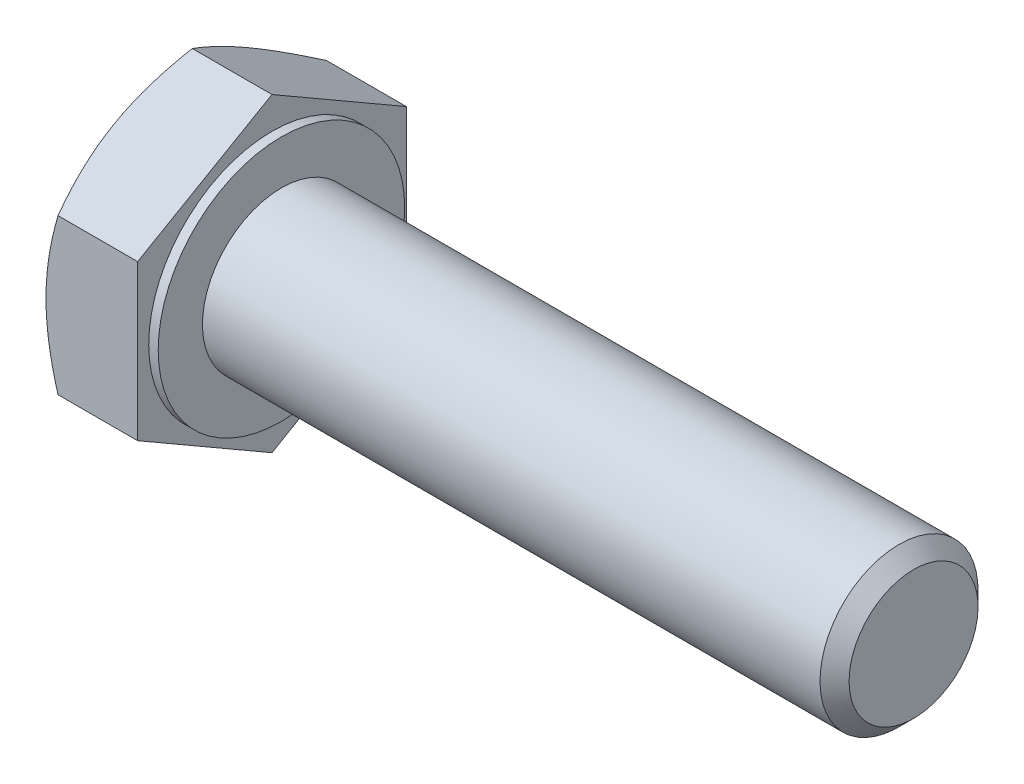
ISO-10303-21;
HEADER;
FILE_DESCRIPTION(('STEP AP214'),'2;1');
FILE_NAME('part.step','',(''),(''),'','','');
FILE_SCHEMA(('AUTOMOTIVE_DESIGN { 1 0 10303 214 1 1 1 1 }'));
ENDSEC;
DATA;
#1=APPLICATION_CONTEXT('core data for automotive mechanical design processes');
#2=APPLICATION_PROTOCOL_DEFINITION('international standard','automotive_design',2000,#1);
#3=PRODUCT_CONTEXT('',#1,'mechanical');
#4=PRODUCT('Part','Part','',(#3));
#5=PRODUCT_RELATED_PRODUCT_CATEGORY('part','',(#4));
#6=PRODUCT_DEFINITION_FORMATION('','',#4);
#7=PRODUCT_DEFINITION_CONTEXT('part definition',#1,'design');
#8=PRODUCT_DEFINITION('design','',#6,#7);
#9=PRODUCT_DEFINITION_SHAPE('','',#8);
#10=(LENGTH_UNIT() NAMED_UNIT(*) SI_UNIT(.MILLI.,.METRE.));
#11=(NAMED_UNIT(*) PLANE_ANGLE_UNIT() SI_UNIT($,.RADIAN.));
#12=(NAMED_UNIT(*) SI_UNIT($,.STERADIAN.) SOLID_ANGLE_UNIT());
#13=UNCERTAINTY_MEASURE_WITH_UNIT(LENGTH_MEASURE(1.E-05),#10,'distance_accuracy_value','');
#14=(GEOMETRIC_REPRESENTATION_CONTEXT(3) GLOBAL_UNCERTAINTY_ASSIGNED_CONTEXT((#13)) GLOBAL_UNIT_ASSIGNED_CONTEXT((#10,
#11,#12)) REPRESENTATION_CONTEXT('',''));
#15=CARTESIAN_POINT('',(0.,0.,0.));
#16=DIRECTION('',(0.,0.,1.));
#17=DIRECTION('',(1.,0.,0.));
#18=AXIS2_PLACEMENT_3D('',#15,#16,#17);
#19=CARTESIAN_POINT('',(39.5398625,0.,0.));
#20=DIRECTION('',(-1.,0.,0.));
#21=DIRECTION('',(0.,1.,0.));
#22=AXIS2_PLACEMENT_3D('',#19,#20,#21);
#23=CONICAL_SURFACE('',#22,4.5399125,0.785343828859751);
#24=CARTESIAN_POINT('',(39.079725,0.,0.));
#25=DIRECTION('',(1.,0.,0.));
#26=DIRECTION('',(0.,1.,0.));
#27=AXIS2_PLACEMENT_3D('',#24,#25,#26);
#28=CIRCLE('',#27,5.);
#29=CARTESIAN_POINT('',(39.079725,5.00000000000001,0.));
#30=VERTEX_POINT('',#29);
#31=EDGE_CURVE('E10',#30,#30,#28,.T.);
#32=ORIENTED_EDGE('',*,*,#31,.T.);
#33=EDGE_LOOP('',(#32));
#34=FACE_BOUND('',#33,.T.);
#35=CARTESIAN_POINT('',(40.,0.,0.));
#36=DIRECTION('',(-1.,0.,0.));
#37=DIRECTION('',(0.,1.,0.));
#38=AXIS2_PLACEMENT_3D('',#35,#36,#37);
#39=CIRCLE('',#38,4.079825);
#40=CARTESIAN_POINT('',(40.,4.07982500000001,0.));
#41=VERTEX_POINT('',#40);
#42=EDGE_CURVE('E26',#41,#41,#39,.T.);
#43=ORIENTED_EDGE('',*,*,#42,.T.);
#44=EDGE_LOOP('',(#43));
#45=FACE_BOUND('',#44,.T.);
#46=ADVANCED_FACE('F16',(#34,#45),#23,.T.);
#47=CARTESIAN_POINT('',(27.,0.,0.));
#48=DIRECTION('',(1.,0.,0.));
#49=DIRECTION('',(0.,1.,0.));
#50=AXIS2_PLACEMENT_3D('',#47,#48,#49);
#51=CYLINDRICAL_SURFACE('',#50,5.);
#52=CARTESIAN_POINT('',(0.,0.,0.));
#53=DIRECTION('',(1.,0.,0.));
#54=DIRECTION('',(0.,1.,0.));
#55=AXIS2_PLACEMENT_3D('',#52,#53,#54);
#56=CIRCLE('',#55,5.);
#57=CARTESIAN_POINT('',(0.,5.,0.));
#58=VERTEX_POINT('',#57);
#59=EDGE_CURVE('E165',#58,#58,#56,.T.);
#60=ORIENTED_EDGE('',*,*,#59,.T.);
#61=EDGE_LOOP('',(#60));
#62=FACE_BOUND('',#61,.T.);
#63=ORIENTED_EDGE('',*,*,#31,.F.);
#64=EDGE_LOOP('',(#63));
#65=FACE_BOUND('',#64,.T.);
#66=ADVANCED_FACE('F251',(#62,#65),#51,.T.);
#67=CARTESIAN_POINT('',(40.,2.5,0.));
#68=DIRECTION('',(1.,0.,0.));
#69=DIRECTION('',(0.,1.,0.));
#70=AXIS2_PLACEMENT_3D('',#67,#68,#69);
#71=PLANE('',#70);
#72=ORIENTED_EDGE('',*,*,#42,.F.);
#73=EDGE_LOOP('',(#72));
#74=FACE_BOUND('',#73,.T.);
#75=ADVANCED_FACE('F248',(#74),#71,.T.);
#76=CARTESIAN_POINT('',(-6.02050531072259,0.,0.));
#77=DIRECTION('',(1.,0.,0.));
#78=DIRECTION('',(0.,0.,1.));
#79=AXIS2_PLACEMENT_3D('',#76,#77,#78);
#80=CONICAL_SURFACE('',#79,9.15747728811181,1.0471975511966);
#81=CARTESIAN_POINT('',(-6.40010000000001,7.36121593216772,4.25));
#82=CARTESIAN_POINT('',(-6.40010000000001,6.22243186433545,6.22243186433546));
#83=CARTESIAN_POINT('',(-5.64091062144518,4.90747728811182,8.49999999999998));
#84=(BOUNDED_CURVE() B_SPLINE_CURVE(2,(#81,#82,#83),.UNSPECIFIED.,.F.,
.F.) B_SPLINE_CURVE_WITH_KNOTS((3,3),(0.497853260958954,0.995706521917907),
.UNSPECIFIED.) CURVE() GEOMETRIC_REPRESENTATION_ITEM() RATIONAL_B_SPLINE_CURVE((1.,
1.03795484930204,1.)) REPRESENTATION_ITEM(''));
#85=CARTESIAN_POINT('',(-6.40010000000001,7.36121593216772,4.25));
#86=VERTEX_POINT('',#85);
#87=CARTESIAN_POINT('',(-5.64091062144518,4.90747728811178,8.5));
#88=VERTEX_POINT('',#87);
#89=EDGE_CURVE('E140',#86,#88,#84,.T.);
#90=ORIENTED_EDGE('',*,*,#89,.F.);
#91=CARTESIAN_POINT('',(-6.4001,0.,0.));
#92=DIRECTION('',(-1.,0.,0.));
#93=DIRECTION('',(0.,1.,0.));
#94=AXIS2_PLACEMENT_3D('',#91,#92,#93);
#95=CIRCLE('',#94,8.50000000000003);
#96=CARTESIAN_POINT('',(-6.40010000000001,0.,8.49999999999999));
#97=VERTEX_POINT('',#96);
#98=EDGE_CURVE('E118',#97,#86,#95,.T.);
#99=ORIENTED_EDGE('',*,*,#98,.F.);
#100=CARTESIAN_POINT('',(-5.64091062144518,4.90747728811178,8.5));
#101=CARTESIAN_POINT('',(-6.40010000000001,2.27756813566452,8.5));
#102=CARTESIAN_POINT('',(-6.40010000000001,0.,8.49999999999999));
#103=(BOUNDED_CURVE() B_SPLINE_CURVE(2,(#100,#101,#102),.UNSPECIFIED.,.F.,
.F.) B_SPLINE_CURVE_WITH_KNOTS((3,3),(0.,0.497853260958954),
.UNSPECIFIED.) CURVE() GEOMETRIC_REPRESENTATION_ITEM() RATIONAL_B_SPLINE_CURVE((1.,
1.03795484930205,1.)) REPRESENTATION_ITEM(''));
#104=EDGE_CURVE('E135',#88,#97,#103,.T.);
#105=ORIENTED_EDGE('',*,*,#104,.F.);
#106=EDGE_LOOP('',(#90,#99,#105));
#107=FACE_BOUND('',#106,.T.);
#108=ADVANCED_FACE('F250',(#107),#80,.T.);
#109=CARTESIAN_POINT('',(-6.02050531072259,0.,0.));
#110=DIRECTION('',(1.,0.,0.));
#111=DIRECTION('',(0.,0.,1.));
#112=AXIS2_PLACEMENT_3D('',#109,#110,#111);
#113=CONICAL_SURFACE('',#112,9.15747728811181,1.0471975511966);
#114=CARTESIAN_POINT('',(-5.64091062144518,-4.90747728811184,8.49999999999997));
#115=CARTESIAN_POINT('',(-6.40010000000002,-6.22243186433546,6.22243186433544));
#116=CARTESIAN_POINT('',(-6.40010000000001,-7.36121593216773,4.24999999999999));
#117=(BOUNDED_CURVE() B_SPLINE_CURVE(2,(#114,#115,#116),.UNSPECIFIED.,.F.,
.F.) B_SPLINE_CURVE_WITH_KNOTS((3,3),(0.,0.497853260958953),
.UNSPECIFIED.) CURVE() GEOMETRIC_REPRESENTATION_ITEM() RATIONAL_B_SPLINE_CURVE((1.,
1.03795484930201,1.)) REPRESENTATION_ITEM(''));
#118=CARTESIAN_POINT('',(-5.64091062144518,-4.90747728811179,8.49999999999999));
#119=VERTEX_POINT('',#118);
#120=CARTESIAN_POINT('',(-6.40010000000001,-7.36121593216773,4.24999999999999));
#121=VERTEX_POINT('',#120);
#122=EDGE_CURVE('E116',#119,#121,#117,.T.);
#123=ORIENTED_EDGE('',*,*,#122,.F.);
#124=CARTESIAN_POINT('',(-6.40010000000001,0.,8.49999999999999));
#125=CARTESIAN_POINT('',(-6.40010000000001,-2.27756813566454,8.49999999999999));
#126=CARTESIAN_POINT('',(-5.64091062144518,-4.90747728811179,8.49999999999999));
#127=(BOUNDED_CURVE() B_SPLINE_CURVE(2,(#124,#125,#126),.UNSPECIFIED.,.F.,
.F.) B_SPLINE_CURVE_WITH_KNOTS((3,3),(0.497853260958954,0.995706521917907),
.UNSPECIFIED.) CURVE() GEOMETRIC_REPRESENTATION_ITEM() RATIONAL_B_SPLINE_CURVE((1.,
1.03795484930206,1.)) REPRESENTATION_ITEM(''));
#128=EDGE_CURVE('E134',#97,#119,#127,.T.);
#129=ORIENTED_EDGE('',*,*,#128,.F.);
#130=CARTESIAN_POINT('',(-6.4001,0.,0.));
#131=DIRECTION('',(-1.,0.,0.));
#132=DIRECTION('',(0.,1.,0.));
#133=AXIS2_PLACEMENT_3D('',#130,#131,#132);
#134=CIRCLE('',#133,8.50000000000003);
#135=EDGE_CURVE('E125',#121,#97,#134,.T.);
#136=ORIENTED_EDGE('',*,*,#135,.F.);
#137=EDGE_LOOP('',(#123,#129,#136));
#138=FACE_BOUND('',#137,.T.);
#139=ADVANCED_FACE('F258',(#138),#113,.T.);
#140=CARTESIAN_POINT('',(-6.02050531072259,0.,0.));
#141=DIRECTION('',(1.,0.,0.));
#142=DIRECTION('',(0.,0.,1.));
#143=AXIS2_PLACEMENT_3D('',#140,#141,#142);
#144=CONICAL_SURFACE('',#143,9.15747728811181,1.0471975511966);
#145=CARTESIAN_POINT('',(-6.40010000000001,7.36121593216772,-4.24999999999999));
#146=CARTESIAN_POINT('',(-6.40010000000002,8.49999999999999,-2.27756813566454));
#147=CARTESIAN_POINT('',(-5.64091062144518,9.81495457622362,0.));
#148=(BOUNDED_CURVE() B_SPLINE_CURVE(2,(#145,#146,#147),.UNSPECIFIED.,.F.,
.F.) B_SPLINE_CURVE_WITH_KNOTS((3,3),(0.497853260958954,0.995706521917909),
.UNSPECIFIED.) CURVE() GEOMETRIC_REPRESENTATION_ITEM() RATIONAL_B_SPLINE_CURVE((1.,
1.03795484930201,1.)) REPRESENTATION_ITEM(''));
#149=CARTESIAN_POINT('',(-6.40010000000001,7.36121593216772,-4.24999999999999));
#150=VERTEX_POINT('',#149);
#151=CARTESIAN_POINT('',(-5.64091062144518,9.81495457622362,0.));
#152=VERTEX_POINT('',#151);
#153=EDGE_CURVE('E148',#150,#152,#148,.T.);
#154=ORIENTED_EDGE('',*,*,#153,.F.);
#155=CARTESIAN_POINT('',(-6.4001,0.,0.));
#156=DIRECTION('',(-1.,0.,0.));
#157=DIRECTION('',(0.,1.,0.));
#158=AXIS2_PLACEMENT_3D('',#155,#156,#157);
#159=CIRCLE('',#158,8.50000000000003);
#160=EDGE_CURVE('E35',#86,#150,#159,.T.);
#161=ORIENTED_EDGE('',*,*,#160,.F.);
#162=CARTESIAN_POINT('',(-5.64091062144518,9.81495457622362,0.));
#163=CARTESIAN_POINT('',(-6.40010000000001,8.49999999999999,2.27756813566456));
#164=CARTESIAN_POINT('',(-6.40010000000001,7.36121593216772,4.25));
#165=(BOUNDED_CURVE() B_SPLINE_CURVE(2,(#162,#163,#164),.UNSPECIFIED.,.F.,
.F.) B_SPLINE_CURVE_WITH_KNOTS((3,3),(0.,0.497853260958954),
.UNSPECIFIED.) CURVE() GEOMETRIC_REPRESENTATION_ITEM() RATIONAL_B_SPLINE_CURVE((1.,
1.03795484930205,1.)) REPRESENTATION_ITEM(''));
#166=EDGE_CURVE('E149',#152,#86,#165,.T.);
#167=ORIENTED_EDGE('',*,*,#166,.F.);
#168=EDGE_LOOP('',(#154,#161,#167));
#169=FACE_BOUND('',#168,.T.);
#170=ADVANCED_FACE('F272',(#169),#144,.T.);
#171=CARTESIAN_POINT('',(-6.02050531072259,0.,0.));
#172=DIRECTION('',(1.,0.,0.));
#173=DIRECTION('',(0.,0.,1.));
#174=AXIS2_PLACEMENT_3D('',#171,#172,#173);
#175=CONICAL_SURFACE('',#174,9.15747728811181,1.0471975511966);
#176=CARTESIAN_POINT('',(-5.64091062144518,-9.81495457622362,0.));
#177=CARTESIAN_POINT('',(-6.40010000000001,-8.49999999999999,-2.27756813566456));
#178=CARTESIAN_POINT('',(-6.40010000000001,-7.36121593216772,-4.25));
#179=(BOUNDED_CURVE() B_SPLINE_CURVE(2,(#176,#177,#178),.UNSPECIFIED.,.F.,
.F.) B_SPLINE_CURVE_WITH_KNOTS((3,3),(0.,0.497853260958953),
.UNSPECIFIED.) CURVE() GEOMETRIC_REPRESENTATION_ITEM() RATIONAL_B_SPLINE_CURVE((1.,
1.03795484930204,1.)) REPRESENTATION_ITEM(''));
#180=CARTESIAN_POINT('',(-5.64091062144518,-9.81495457622362,0.));
#181=VERTEX_POINT('',#180);
#182=CARTESIAN_POINT('',(-6.40010000000001,-7.36121593216772,-4.25));
#183=VERTEX_POINT('',#182);
#184=EDGE_CURVE('E115',#181,#183,#179,.T.);
#185=ORIENTED_EDGE('',*,*,#184,.F.);
#186=CARTESIAN_POINT('',(-6.40010000000001,-7.36121593216773,4.24999999999999));
#187=CARTESIAN_POINT('',(-6.40010000000001,-8.49999999999999,2.27756813566454));
#188=CARTESIAN_POINT('',(-5.64091062144518,-9.81495457622362,0.));
#189=(BOUNDED_CURVE() B_SPLINE_CURVE(2,(#186,#187,#188),.UNSPECIFIED.,.F.,
.F.) B_SPLINE_CURVE_WITH_KNOTS((3,3),(0.497853260958953,0.995706521917907),
.UNSPECIFIED.) CURVE() GEOMETRIC_REPRESENTATION_ITEM() RATIONAL_B_SPLINE_CURVE((1.,
1.03795484930204,1.)) REPRESENTATION_ITEM(''));
#190=EDGE_CURVE('E113',#121,#181,#189,.T.);
#191=ORIENTED_EDGE('',*,*,#190,.F.);
#192=CARTESIAN_POINT('',(-6.4001,0.,0.));
#193=DIRECTION('',(-1.,0.,0.));
#194=DIRECTION('',(0.,1.,0.));
#195=AXIS2_PLACEMENT_3D('',#192,#193,#194);
#196=CIRCLE('',#195,8.50000000000003);
#197=EDGE_CURVE('E153',#183,#121,#196,.T.);
#198=ORIENTED_EDGE('',*,*,#197,.F.);
#199=EDGE_LOOP('',(#185,#191,#198));
#200=FACE_BOUND('',#199,.T.);
#201=ADVANCED_FACE('F277',(#200),#175,.T.);
#202=CARTESIAN_POINT('',(-6.02050531072259,0.,0.));
#203=DIRECTION('',(1.,0.,0.));
#204=DIRECTION('',(0.,0.,1.));
#205=AXIS2_PLACEMENT_3D('',#202,#203,#204);
#206=CONICAL_SURFACE('',#205,9.15747728811181,1.0471975511966);
#207=CARTESIAN_POINT('',(-6.40010000000001,0.,-8.49999999999999));
#208=CARTESIAN_POINT('',(-6.40010000000001,2.27756813566453,-8.49999999999999));
#209=CARTESIAN_POINT('',(-5.64091062144518,4.90747728811179,-8.49999999999999));
#210=(BOUNDED_CURVE() B_SPLINE_CURVE(2,(#207,#208,#209),.UNSPECIFIED.,.F.,
.F.) B_SPLINE_CURVE_WITH_KNOTS((3,3),(0.497853260958953,0.995706521917907),
.UNSPECIFIED.) CURVE() GEOMETRIC_REPRESENTATION_ITEM() RATIONAL_B_SPLINE_CURVE((1.,
1.03795484930205,1.)) REPRESENTATION_ITEM(''));
#211=CARTESIAN_POINT('',(-6.40010000000001,0.,-8.49999999999999));
#212=VERTEX_POINT('',#211);
#213=CARTESIAN_POINT('',(-5.64091062144518,4.90747728811179,-8.49999999999999));
#214=VERTEX_POINT('',#213);
#215=EDGE_CURVE('E142',#212,#214,#210,.T.);
#216=ORIENTED_EDGE('',*,*,#215,.F.);
#217=CARTESIAN_POINT('',(-6.4001,0.,0.));
#218=DIRECTION('',(-1.,0.,0.));
#219=DIRECTION('',(0.,1.,0.));
#220=AXIS2_PLACEMENT_3D('',#217,#218,#219);
#221=CIRCLE('',#220,8.50000000000003);
#222=EDGE_CURVE('E152',#150,#212,#221,.T.);
#223=ORIENTED_EDGE('',*,*,#222,.F.);
#224=CARTESIAN_POINT('',(-5.64091062144518,4.90747728811183,-8.49999999999997));
#225=CARTESIAN_POINT('',(-6.40010000000002,6.22243186433546,-6.22243186433544));
#226=CARTESIAN_POINT('',(-6.40010000000001,7.36121593216772,-4.24999999999999));
#227=(BOUNDED_CURVE() B_SPLINE_CURVE(2,(#224,#225,#226),.UNSPECIFIED.,.F.,
.F.) B_SPLINE_CURVE_WITH_KNOTS((3,3),(0.,0.497853260958954),
.UNSPECIFIED.) CURVE() GEOMETRIC_REPRESENTATION_ITEM() RATIONAL_B_SPLINE_CURVE((1.,
1.03795484930202,1.)) REPRESENTATION_ITEM(''));
#228=EDGE_CURVE('E143',#214,#150,#227,.T.);
#229=ORIENTED_EDGE('',*,*,#228,.F.);
#230=EDGE_LOOP('',(#216,#223,#229));
#231=FACE_BOUND('',#230,.T.);
#232=ADVANCED_FACE('F280',(#231),#206,.T.);
#233=CARTESIAN_POINT('',(-6.02050531072259,0.,0.));
#234=DIRECTION('',(1.,0.,0.));
#235=DIRECTION('',(0.,0.,1.));
#236=AXIS2_PLACEMENT_3D('',#233,#234,#235);
#237=CONICAL_SURFACE('',#236,9.15747728811181,1.0471975511966);
#238=CARTESIAN_POINT('',(-5.64091062144518,-4.90747728811179,-8.5));
#239=CARTESIAN_POINT('',(-6.40010000000001,-2.27756813566453,-8.5));
#240=CARTESIAN_POINT('',(-6.40010000000001,0.,-8.49999999999999));
#241=(BOUNDED_CURVE() B_SPLINE_CURVE(2,(#238,#239,#240),.UNSPECIFIED.,.F.,
.F.) B_SPLINE_CURVE_WITH_KNOTS((3,3),(0.,0.497853260958953),
.UNSPECIFIED.) CURVE() GEOMETRIC_REPRESENTATION_ITEM() RATIONAL_B_SPLINE_CURVE((1.,
1.03795484930204,1.)) REPRESENTATION_ITEM(''));
#242=CARTESIAN_POINT('',(-5.64091062144518,-4.90747728811183,-8.49999999999997));
#243=VERTEX_POINT('',#242);
#244=EDGE_CURVE('E157',#243,#212,#241,.T.);
#245=ORIENTED_EDGE('',*,*,#244,.F.);
#246=CARTESIAN_POINT('',(-6.40010000000001,-7.36121593216772,-4.25));
#247=CARTESIAN_POINT('',(-6.40010000000001,-6.22243186433546,-6.22243186433544));
#248=CARTESIAN_POINT('',(-5.64091062144518,-4.90747728811183,-8.49999999999997));
#249=(BOUNDED_CURVE() B_SPLINE_CURVE(2,(#246,#247,#248),.UNSPECIFIED.,.F.,
.F.) B_SPLINE_CURVE_WITH_KNOTS((3,3),(0.497853260958953,0.995706521917907),
.UNSPECIFIED.) CURVE() GEOMETRIC_REPRESENTATION_ITEM() RATIONAL_B_SPLINE_CURVE((1.,
1.03795484930204,1.)) REPRESENTATION_ITEM(''));
#250=EDGE_CURVE('E114',#183,#243,#249,.T.);
#251=ORIENTED_EDGE('',*,*,#250,.F.);
#252=CARTESIAN_POINT('',(-6.4001,0.,0.));
#253=DIRECTION('',(-1.,0.,0.));
#254=DIRECTION('',(0.,1.,0.));
#255=AXIS2_PLACEMENT_3D('',#252,#253,#254);
#256=CIRCLE('',#255,8.50000000000003);
#257=EDGE_CURVE('E150',#212,#183,#256,.T.);
#258=ORIENTED_EDGE('',*,*,#257,.F.);
#259=EDGE_LOOP('',(#245,#251,#258));
#260=FACE_BOUND('',#259,.T.);
#261=ADVANCED_FACE('F283',(#260),#237,.T.);
#262=CARTESIAN_POINT('',(-0.600099999999993,-4.90747728811181,-8.5));
#263=DIRECTION('',(0.,0.,-1.));
#264=DIRECTION('',(0.,1.,0.));
#265=AXIS2_PLACEMENT_3D('',#262,#263,#264);
#266=PLANE('',#265);
#267=ORIENTED_EDGE('',*,*,#244,.T.);
#268=ORIENTED_EDGE('',*,*,#215,.T.);
#269=DIRECTION('',(-1.,0.,0.));
#270=VECTOR('',#269,1.);
#271=CARTESIAN_POINT('',(-0.600099999999995,4.90747728811182,-8.49999999999999));
#272=LINE('',#271,#270);
#273=CARTESIAN_POINT('',(-0.600099999999995,4.90747728811182,-8.49999999999999));
#274=VERTEX_POINT('',#273);
#275=EDGE_CURVE('E145',#274,#214,#272,.T.);
#276=ORIENTED_EDGE('',*,*,#275,.F.);
#277=DIRECTION('',(0.,1.,0.));
#278=VECTOR('',#277,1.);
#279=CARTESIAN_POINT('',(-0.600099999999993,-4.90747728811181,-8.5));
#280=LINE('',#279,#278);
#281=CARTESIAN_POINT('',(-0.600099999999993,-4.90747728811181,-8.5));
#282=VERTEX_POINT('',#281);
#283=EDGE_CURVE('E100',#282,#274,#280,.T.);
#284=ORIENTED_EDGE('',*,*,#283,.F.);
#285=DIRECTION('',(-1.,0.,0.));
#286=VECTOR('',#285,1.);
#287=CARTESIAN_POINT('',(-0.600099999999993,-4.90747728811181,-8.5));
#288=LINE('',#287,#286);
#289=EDGE_CURVE('E98',#282,#243,#288,.T.);
#290=ORIENTED_EDGE('',*,*,#289,.T.);
#291=EDGE_LOOP('',(#267,#268,#276,#284,#290));
#292=FACE_BOUND('',#291,.T.);
#293=ADVANCED_FACE('F286',(#292),#266,.T.);
#294=CARTESIAN_POINT('',(-0.600099999999995,4.90747728811182,-8.49999999999999));
#295=DIRECTION('',(0.,0.866025403784439,-0.5));
#296=DIRECTION('',(0.,0.5,0.866025403784439));
#297=AXIS2_PLACEMENT_3D('',#294,#295,#296);
#298=PLANE('',#297);
#299=ORIENTED_EDGE('',*,*,#228,.T.);
#300=ORIENTED_EDGE('',*,*,#153,.T.);
#301=DIRECTION('',(-1.,0.,0.));
#302=VECTOR('',#301,1.);
#303=CARTESIAN_POINT('',(-0.600099999999995,9.81495457622363,0.));
#304=LINE('',#303,#302);
#305=CARTESIAN_POINT('',(-0.600099999999995,9.81495457622363,0.));
#306=VERTEX_POINT('',#305);
#307=EDGE_CURVE('E130',#306,#152,#304,.T.);
#308=ORIENTED_EDGE('',*,*,#307,.F.);
#309=DIRECTION('',(0.,0.5,0.866025403784439));
#310=VECTOR('',#309,1.);
#311=CARTESIAN_POINT('',(-0.600099999999995,4.90747728811182,-8.49999999999999));
#312=LINE('',#311,#310);
#313=EDGE_CURVE('E136',#274,#306,#312,.T.);
#314=ORIENTED_EDGE('',*,*,#313,.F.);
#315=ORIENTED_EDGE('',*,*,#275,.T.);
#316=EDGE_LOOP('',(#299,#300,#308,#314,#315));
#317=FACE_BOUND('',#316,.T.);
#318=ADVANCED_FACE('F291',(#317),#298,.T.);
#319=CARTESIAN_POINT('',(-0.600099999999995,9.81495457622363,0.));
#320=DIRECTION('',(0.,0.866025403784438,0.500000000000001));
#321=DIRECTION('',(0.,-0.500000000000001,0.866025403784438));
#322=AXIS2_PLACEMENT_3D('',#319,#320,#321);
#323=PLANE('',#322);
#324=ORIENTED_EDGE('',*,*,#166,.T.);
#325=ORIENTED_EDGE('',*,*,#89,.T.);
#326=DIRECTION('',(-1.,0.,0.));
#327=VECTOR('',#326,1.);
#328=CARTESIAN_POINT('',(-0.600099999999995,4.90747728811181,8.5));
#329=LINE('',#328,#327);
#330=CARTESIAN_POINT('',(-0.600099999999995,4.90747728811181,8.5));
#331=VERTEX_POINT('',#330);
#332=EDGE_CURVE('E131',#331,#88,#329,.T.);
#333=ORIENTED_EDGE('',*,*,#332,.F.);
#334=DIRECTION('',(0.,-0.500000000000001,0.866025403784438));
#335=VECTOR('',#334,1.);
#336=CARTESIAN_POINT('',(-0.600099999999995,9.81495457622363,0.));
#337=LINE('',#336,#335);
#338=EDGE_CURVE('E128',#306,#331,#337,.T.);
#339=ORIENTED_EDGE('',*,*,#338,.F.);
#340=ORIENTED_EDGE('',*,*,#307,.T.);
#341=EDGE_LOOP('',(#324,#325,#333,#339,#340));
#342=FACE_BOUND('',#341,.T.);
#343=ADVANCED_FACE('F302',(#342),#323,.T.);
#344=CARTESIAN_POINT('',(-0.600099999999994,0.,0.));
#345=DIRECTION('',(1.,0.,0.));
#346=DIRECTION('',(0.,1.,0.));
#347=AXIS2_PLACEMENT_3D('',#344,#345,#346);
#348=PLANE('',#347);
#349=ORIENTED_EDGE('',*,*,#338,.T.);
#350=DIRECTION('',(0.,-1.,0.));
#351=VECTOR('',#350,1.);
#352=CARTESIAN_POINT('',(-0.600099999999995,4.90747728811181,8.5));
#353=LINE('',#352,#351);
#354=CARTESIAN_POINT('',(-0.600099999999993,-4.90747728811182,8.49999999999999));
#355=VERTEX_POINT('',#354);
#356=EDGE_CURVE('E106',#331,#355,#353,.T.);
#357=ORIENTED_EDGE('',*,*,#356,.T.);
#358=DIRECTION('',(0.,-0.5,-0.866025403784439));
#359=VECTOR('',#358,1.);
#360=CARTESIAN_POINT('',(-0.600099999999993,-4.90747728811182,8.49999999999999));
#361=LINE('',#360,#359);
#362=CARTESIAN_POINT('',(-0.600099999999993,-9.81495457622363,0.));
#363=VERTEX_POINT('',#362);
#364=EDGE_CURVE('E86',#355,#363,#361,.T.);
#365=ORIENTED_EDGE('',*,*,#364,.T.);
#366=DIRECTION('',(0.,0.5,-0.866025403784438));
#367=VECTOR('',#366,1.);
#368=CARTESIAN_POINT('',(-0.600099999999993,-9.81495457622363,0.));
#369=LINE('',#368,#367);
#370=EDGE_CURVE('E93',#363,#282,#369,.T.);
#371=ORIENTED_EDGE('',*,*,#370,.T.);
#372=ORIENTED_EDGE('',*,*,#283,.T.);
#373=ORIENTED_EDGE('',*,*,#313,.T.);
#374=EDGE_LOOP('',(#349,#357,#365,#371,#372,#373));
#375=FACE_BOUND('',#374,.T.);
#376=CARTESIAN_POINT('',(-0.600099999999992,0.,0.));
#377=DIRECTION('',(1.,0.,0.));
#378=DIRECTION('',(0.,1.,0.));
#379=AXIS2_PLACEMENT_3D('',#376,#377,#378);
#380=CIRCLE('',#379,7.8);
#381=CARTESIAN_POINT('',(-0.600099999999992,7.8,0.));
#382=VERTEX_POINT('',#381);
#383=EDGE_CURVE('E123',#382,#382,#380,.T.);
#384=ORIENTED_EDGE('',*,*,#383,.F.);
#385=EDGE_LOOP('',(#384));
#386=FACE_BOUND('',#385,.T.);
#387=ADVANCED_FACE('F103',(#375,#386),#348,.T.);
#388=CARTESIAN_POINT('',(-0.600099999999995,4.90747728811181,8.5));
#389=DIRECTION('',(0.,0.,1.));
#390=DIRECTION('',(0.,-1.,0.));
#391=AXIS2_PLACEMENT_3D('',#388,#389,#390);
#392=PLANE('',#391);
#393=ORIENTED_EDGE('',*,*,#128,.T.);
#394=DIRECTION('',(-1.,0.,0.));
#395=VECTOR('',#394,1.);
#396=CARTESIAN_POINT('',(-0.600099999999993,-4.90747728811182,8.49999999999999));
#397=LINE('',#396,#395);
#398=EDGE_CURVE('E121',#355,#119,#397,.T.);
#399=ORIENTED_EDGE('',*,*,#398,.F.);
#400=ORIENTED_EDGE('',*,*,#356,.F.);
#401=ORIENTED_EDGE('',*,*,#332,.T.);
#402=ORIENTED_EDGE('',*,*,#104,.T.);
#403=EDGE_LOOP('',(#393,#399,#400,#401,#402));
#404=FACE_BOUND('',#403,.T.);
#405=ADVANCED_FACE('F305',(#404),#392,.T.);
#406=CARTESIAN_POINT('',(-0.600099999999993,-4.90747728811182,8.49999999999999));
#407=DIRECTION('',(0.,-0.866025403784439,0.5));
#408=DIRECTION('',(0.,-0.5,-0.866025403784439));
#409=AXIS2_PLACEMENT_3D('',#406,#407,#408);
#410=PLANE('',#409);
#411=ORIENTED_EDGE('',*,*,#190,.T.);
#412=DIRECTION('',(-1.,0.,0.));
#413=VECTOR('',#412,1.);
#414=CARTESIAN_POINT('',(-0.600099999999993,-9.81495457622363,0.));
#415=LINE('',#414,#413);
#416=EDGE_CURVE('E96',#363,#181,#415,.T.);
#417=ORIENTED_EDGE('',*,*,#416,.F.);
#418=ORIENTED_EDGE('',*,*,#364,.F.);
#419=ORIENTED_EDGE('',*,*,#398,.T.);
#420=ORIENTED_EDGE('',*,*,#122,.T.);
#421=EDGE_LOOP('',(#411,#417,#418,#419,#420));
#422=FACE_BOUND('',#421,.T.);
#423=ADVANCED_FACE('F110',(#422),#410,.T.);
#424=CARTESIAN_POINT('',(-0.600099999999993,-9.81495457622363,0.));
#425=DIRECTION('',(0.,-0.866025403784438,-0.5));
#426=DIRECTION('',(0.,0.5,-0.866025403784438));
#427=AXIS2_PLACEMENT_3D('',#424,#425,#426);
#428=PLANE('',#427);
#429=ORIENTED_EDGE('',*,*,#250,.T.);
#430=ORIENTED_EDGE('',*,*,#289,.F.);
#431=ORIENTED_EDGE('',*,*,#370,.F.);
#432=ORIENTED_EDGE('',*,*,#416,.T.);
#433=ORIENTED_EDGE('',*,*,#184,.T.);
#434=EDGE_LOOP('',(#429,#430,#431,#432,#433));
#435=FACE_BOUND('',#434,.T.);
#436=ADVANCED_FACE('F94',(#435),#428,.T.);
#437=CARTESIAN_POINT('',(-6.4001,0.,0.));
#438=DIRECTION('',(1.,0.,0.));
#439=DIRECTION('',(0.,1.,0.));
#440=AXIS2_PLACEMENT_3D('',#437,#438,#439);
#441=PLANE('',#440);
#442=ORIENTED_EDGE('',*,*,#98,.T.);
#443=ORIENTED_EDGE('',*,*,#160,.T.);
#444=ORIENTED_EDGE('',*,*,#222,.T.);
#445=ORIENTED_EDGE('',*,*,#257,.T.);
#446=ORIENTED_EDGE('',*,*,#197,.T.);
#447=ORIENTED_EDGE('',*,*,#135,.T.);
#448=EDGE_LOOP('',(#442,#443,#444,#445,#446,#447));
#449=FACE_BOUND('',#448,.T.);
#450=ADVANCED_FACE('F308',(#449),#441,.F.);
#451=CARTESIAN_POINT('',(-0.300050000000001,0.,0.));
#452=DIRECTION('',(1.,0.,0.));
#453=DIRECTION('',(0.,1.,0.));
#454=AXIS2_PLACEMENT_3D('',#451,#452,#453);
#455=CYLINDRICAL_SURFACE('',#454,7.8);
#456=CARTESIAN_POINT('',(0.,0.,0.));
#457=DIRECTION('',(1.,0.,0.));
#458=DIRECTION('',(0.,1.,0.));
#459=AXIS2_PLACEMENT_3D('',#456,#457,#458);
#460=CIRCLE('',#459,7.8);
#461=CARTESIAN_POINT('',(0.,7.8,0.));
#462=VERTEX_POINT('',#461);
#463=EDGE_CURVE('E20',#462,#462,#460,.T.);
#464=ORIENTED_EDGE('',*,*,#463,.F.);
#465=EDGE_LOOP('',(#464));
#466=FACE_BOUND('',#465,.T.);
#467=ORIENTED_EDGE('',*,*,#383,.T.);
#468=EDGE_LOOP('',(#467));
#469=FACE_BOUND('',#468,.T.);
#470=ADVANCED_FACE('F18',(#466,#469),#455,.T.);
#471=CARTESIAN_POINT('',(0.,6.4,0.));
#472=DIRECTION('',(1.,0.,0.));
#473=DIRECTION('',(0.,1.,0.));
#474=AXIS2_PLACEMENT_3D('',#471,#472,#473);
#475=PLANE('',#474);
#476=ORIENTED_EDGE('',*,*,#59,.F.);
#477=EDGE_LOOP('',(#476));
#478=FACE_BOUND('',#477,.T.);
#479=ORIENTED_EDGE('',*,*,#463,.T.);
#480=EDGE_LOOP('',(#479));
#481=FACE_BOUND('',#480,.T.);
#482=ADVANCED_FACE('F316',(#478,#481),#475,.T.);
#483=CLOSED_SHELL('',(#46,#66,#75,#108,#139,#170,#201,#232,#261,#293,#318,#343,#387,#405,#423,
#436,#450,#470,#482));
#484=MANIFOLD_SOLID_BREP('B1',#483);
#485=ADVANCED_BREP_SHAPE_REPRESENTATION('',(#18,#484),#14);
#486=SHAPE_DEFINITION_REPRESENTATION(#9,#485);
ENDSEC;
END-ISO-10303-21;
